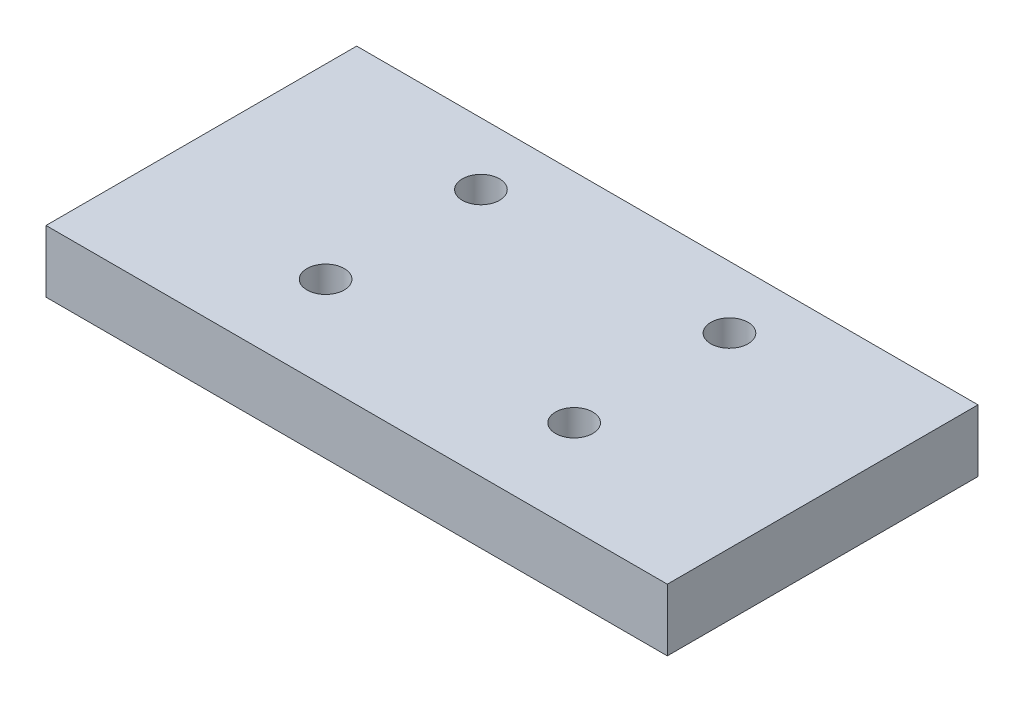
ISO-10303-21;
HEADER;
FILE_DESCRIPTION(('STEP AP214'),'2;1');
FILE_NAME('part.step','',(''),(''),'','','');
FILE_SCHEMA(('AUTOMOTIVE_DESIGN { 1 0 10303 214 1 1 1 1 }'));
ENDSEC;
DATA;
#1=APPLICATION_CONTEXT('core data for automotive mechanical design processes');
#2=APPLICATION_PROTOCOL_DEFINITION('international standard','automotive_design',2000,#1);
#3=PRODUCT_CONTEXT('',#1,'mechanical');
#4=PRODUCT('Part','Part','',(#3));
#5=PRODUCT_RELATED_PRODUCT_CATEGORY('part','',(#4));
#6=PRODUCT_DEFINITION_FORMATION('','',#4);
#7=PRODUCT_DEFINITION_CONTEXT('part definition',#1,'design');
#8=PRODUCT_DEFINITION('design','',#6,#7);
#9=PRODUCT_DEFINITION_SHAPE('','',#8);
#10=(LENGTH_UNIT() NAMED_UNIT(*) SI_UNIT(.MILLI.,.METRE.));
#11=(NAMED_UNIT(*) PLANE_ANGLE_UNIT() SI_UNIT($,.RADIAN.));
#12=(NAMED_UNIT(*) SI_UNIT($,.STERADIAN.) SOLID_ANGLE_UNIT());
#13=UNCERTAINTY_MEASURE_WITH_UNIT(LENGTH_MEASURE(1.E-05),#10,'distance_accuracy_value','');
#14=(GEOMETRIC_REPRESENTATION_CONTEXT(3) GLOBAL_UNCERTAINTY_ASSIGNED_CONTEXT((#13)) GLOBAL_UNIT_ASSIGNED_CONTEXT((#10,
#11,#12)) REPRESENTATION_CONTEXT('',''));
#15=CARTESIAN_POINT('',(0.,0.,0.));
#16=DIRECTION('',(0.,0.,1.));
#17=DIRECTION('',(1.,0.,0.));
#18=AXIS2_PLACEMENT_3D('',#15,#16,#17);
#19=CARTESIAN_POINT('',(0.,10.,0.));
#20=DIRECTION('',(0.,1.,0.));
#21=DIRECTION('',(0.,0.,1.));
#22=AXIS2_PLACEMENT_3D('',#19,#20,#21);
#23=PLANE('',#22);
#24=CARTESIAN_POINT('',(30.,10.,-40.));
#25=DIRECTION('',(0.,1.,0.));
#26=DIRECTION('',(0.,0.,1.));
#27=AXIS2_PLACEMENT_3D('',#24,#25,#26);
#28=CIRCLE('',#27,3.);
#29=CARTESIAN_POINT('',(30.,10.,-37.));
#30=VERTEX_POINT('',#29);
#31=EDGE_CURVE('E142',#30,#30,#28,.T.);
#32=ORIENTED_EDGE('',*,*,#31,.F.);
#33=EDGE_LOOP('',(#32));
#34=FACE_BOUND('',#33,.T.);
#35=CARTESIAN_POINT('',(30.,10.,-15.));
#36=DIRECTION('',(0.,1.,0.));
#37=DIRECTION('',(0.,0.,1.));
#38=AXIS2_PLACEMENT_3D('',#35,#36,#37);
#39=CIRCLE('',#38,3.);
#40=CARTESIAN_POINT('',(30.,10.,-12.));
#41=VERTEX_POINT('',#40);
#42=EDGE_CURVE('E112',#41,#41,#39,.T.);
#43=ORIENTED_EDGE('',*,*,#42,.F.);
#44=EDGE_LOOP('',(#43));
#45=FACE_BOUND('',#44,.T.);
#46=DIRECTION('',(0.,0.,1.));
#47=VECTOR('',#46,1.);
#48=CARTESIAN_POINT('',(0.,10.,-50.));
#49=LINE('',#48,#47);
#50=CARTESIAN_POINT('',(0.,10.,-50.));
#51=VERTEX_POINT('',#50);
#52=CARTESIAN_POINT('',(0.,10.,0.));
#53=VERTEX_POINT('',#52);
#54=EDGE_CURVE('E92',#51,#53,#49,.T.);
#55=ORIENTED_EDGE('',*,*,#54,.T.);
#56=DIRECTION('',(1.,0.,0.));
#57=VECTOR('',#56,1.);
#58=CARTESIAN_POINT('',(0.,10.,0.));
#59=LINE('',#58,#57);
#60=CARTESIAN_POINT('',(100.,10.,0.));
#61=VERTEX_POINT('',#60);
#62=EDGE_CURVE('E87',#53,#61,#59,.T.);
#63=ORIENTED_EDGE('',*,*,#62,.T.);
#64=DIRECTION('',(0.,0.,-1.));
#65=VECTOR('',#64,1.);
#66=CARTESIAN_POINT('',(100.,10.,0.));
#67=LINE('',#66,#65);
#68=CARTESIAN_POINT('',(100.,10.,-50.));
#69=VERTEX_POINT('',#68);
#70=EDGE_CURVE('E90',#61,#69,#67,.T.);
#71=ORIENTED_EDGE('',*,*,#70,.T.);
#72=DIRECTION('',(-1.,0.,0.));
#73=VECTOR('',#72,1.);
#74=CARTESIAN_POINT('',(100.,10.,-50.));
#75=LINE('',#74,#73);
#76=EDGE_CURVE('E57',#69,#51,#75,.T.);
#77=ORIENTED_EDGE('',*,*,#76,.T.);
#78=EDGE_LOOP('',(#55,#63,#71,#77));
#79=FACE_BOUND('',#78,.T.);
#80=CARTESIAN_POINT('',(70.,10.,-40.));
#81=DIRECTION('',(0.,1.,0.));
#82=DIRECTION('',(0.,0.,1.));
#83=AXIS2_PLACEMENT_3D('',#80,#81,#82);
#84=CIRCLE('',#83,3.00000000000001);
#85=CARTESIAN_POINT('',(70.,10.,-37.));
#86=VERTEX_POINT('',#85);
#87=EDGE_CURVE('E134',#86,#86,#84,.T.);
#88=ORIENTED_EDGE('',*,*,#87,.F.);
#89=EDGE_LOOP('',(#88));
#90=FACE_BOUND('',#89,.T.);
#91=CARTESIAN_POINT('',(70.,10.,-15.));
#92=DIRECTION('',(0.,1.,0.));
#93=DIRECTION('',(0.,0.,1.));
#94=AXIS2_PLACEMENT_3D('',#91,#92,#93);
#95=CIRCLE('',#94,3.00000000000001);
#96=CARTESIAN_POINT('',(70.,10.,-12.));
#97=VERTEX_POINT('',#96);
#98=EDGE_CURVE('E150',#97,#97,#95,.T.);
#99=ORIENTED_EDGE('',*,*,#98,.F.);
#100=EDGE_LOOP('',(#99));
#101=FACE_BOUND('',#100,.T.);
#102=ADVANCED_FACE('F39',(#34,#45,#79,#90,#101),#23,.T.);
#103=CARTESIAN_POINT('',(0.,0.,0.));
#104=DIRECTION('',(0.,1.,0.));
#105=DIRECTION('',(0.,0.,1.));
#106=AXIS2_PLACEMENT_3D('',#103,#104,#105);
#107=PLANE('',#106);
#108=DIRECTION('',(0.,0.,1.));
#109=VECTOR('',#108,1.);
#110=CARTESIAN_POINT('',(0.,0.,-50.));
#111=LINE('',#110,#109);
#112=CARTESIAN_POINT('',(0.,0.,-50.));
#113=VERTEX_POINT('',#112);
#114=CARTESIAN_POINT('',(0.,0.,0.));
#115=VERTEX_POINT('',#114);
#116=EDGE_CURVE('E108',#113,#115,#111,.T.);
#117=ORIENTED_EDGE('',*,*,#116,.F.);
#118=DIRECTION('',(-1.,0.,0.));
#119=VECTOR('',#118,1.);
#120=CARTESIAN_POINT('',(100.,0.,-50.));
#121=LINE('',#120,#119);
#122=CARTESIAN_POINT('',(100.,0.,-50.));
#123=VERTEX_POINT('',#122);
#124=EDGE_CURVE('E80',#123,#113,#121,.T.);
#125=ORIENTED_EDGE('',*,*,#124,.F.);
#126=DIRECTION('',(0.,0.,-1.));
#127=VECTOR('',#126,1.);
#128=CARTESIAN_POINT('',(100.,0.,0.));
#129=LINE('',#128,#127);
#130=CARTESIAN_POINT('',(100.,0.,0.));
#131=VERTEX_POINT('',#130);
#132=EDGE_CURVE('E74',#131,#123,#129,.T.);
#133=ORIENTED_EDGE('',*,*,#132,.F.);
#134=DIRECTION('',(1.,0.,0.));
#135=VECTOR('',#134,1.);
#136=CARTESIAN_POINT('',(0.,0.,0.));
#137=LINE('',#136,#135);
#138=EDGE_CURVE('E97',#115,#131,#137,.T.);
#139=ORIENTED_EDGE('',*,*,#138,.F.);
#140=EDGE_LOOP('',(#117,#125,#133,#139));
#141=FACE_BOUND('',#140,.T.);
#142=CARTESIAN_POINT('',(30.,0.,-15.));
#143=DIRECTION('',(0.,1.,0.));
#144=DIRECTION('',(0.,0.,1.));
#145=AXIS2_PLACEMENT_3D('',#142,#143,#144);
#146=CIRCLE('',#145,3.);
#147=CARTESIAN_POINT('',(30.,0.,-12.));
#148=VERTEX_POINT('',#147);
#149=EDGE_CURVE('E130',#148,#148,#146,.T.);
#150=ORIENTED_EDGE('',*,*,#149,.T.);
#151=EDGE_LOOP('',(#150));
#152=FACE_BOUND('',#151,.T.);
#153=CARTESIAN_POINT('',(70.,0.,-40.));
#154=DIRECTION('',(0.,1.,0.));
#155=DIRECTION('',(0.,0.,1.));
#156=AXIS2_PLACEMENT_3D('',#153,#154,#155);
#157=CIRCLE('',#156,3.00000000000001);
#158=CARTESIAN_POINT('',(70.,0.,-37.));
#159=VERTEX_POINT('',#158);
#160=EDGE_CURVE('E138',#159,#159,#157,.T.);
#161=ORIENTED_EDGE('',*,*,#160,.T.);
#162=EDGE_LOOP('',(#161));
#163=FACE_BOUND('',#162,.T.);
#164=CARTESIAN_POINT('',(30.,0.,-40.));
#165=DIRECTION('',(0.,1.,0.));
#166=DIRECTION('',(0.,0.,1.));
#167=AXIS2_PLACEMENT_3D('',#164,#165,#166);
#168=CIRCLE('',#167,3.);
#169=CARTESIAN_POINT('',(30.,0.,-37.));
#170=VERTEX_POINT('',#169);
#171=EDGE_CURVE('E146',#170,#170,#168,.T.);
#172=ORIENTED_EDGE('',*,*,#171,.T.);
#173=EDGE_LOOP('',(#172));
#174=FACE_BOUND('',#173,.T.);
#175=CARTESIAN_POINT('',(70.,0.,-15.));
#176=DIRECTION('',(0.,1.,0.));
#177=DIRECTION('',(0.,0.,1.));
#178=AXIS2_PLACEMENT_3D('',#175,#176,#177);
#179=CIRCLE('',#178,3.00000000000001);
#180=CARTESIAN_POINT('',(70.,0.,-12.));
#181=VERTEX_POINT('',#180);
#182=EDGE_CURVE('E154',#181,#181,#179,.T.);
#183=ORIENTED_EDGE('',*,*,#182,.T.);
#184=EDGE_LOOP('',(#183));
#185=FACE_BOUND('',#184,.T.);
#186=ADVANCED_FACE('F125',(#141,#152,#163,#174,#185),#107,.F.);
#187=CARTESIAN_POINT('',(0.,10.,-50.));
#188=DIRECTION('',(1.,0.,0.));
#189=DIRECTION('',(0.,0.,-1.));
#190=AXIS2_PLACEMENT_3D('',#187,#188,#189);
#191=PLANE('',#190);
#192=ORIENTED_EDGE('',*,*,#116,.T.);
#193=DIRECTION('',(0.,-1.,0.));
#194=VECTOR('',#193,1.);
#195=CARTESIAN_POINT('',(0.,10.,0.));
#196=LINE('',#195,#194);
#197=EDGE_CURVE('E11',#53,#115,#196,.T.);
#198=ORIENTED_EDGE('',*,*,#197,.F.);
#199=ORIENTED_EDGE('',*,*,#54,.F.);
#200=DIRECTION('',(0.,-1.,0.));
#201=VECTOR('',#200,1.);
#202=CARTESIAN_POINT('',(0.,10.,-50.));
#203=LINE('',#202,#201);
#204=EDGE_CURVE('E104',#51,#113,#203,.T.);
#205=ORIENTED_EDGE('',*,*,#204,.T.);
#206=EDGE_LOOP('',(#192,#198,#199,#205));
#207=FACE_BOUND('',#206,.T.);
#208=ADVANCED_FACE('F41',(#207),#191,.F.);
#209=CARTESIAN_POINT('',(0.,10.,0.));
#210=DIRECTION('',(0.,0.,-1.));
#211=DIRECTION('',(-1.,0.,0.));
#212=AXIS2_PLACEMENT_3D('',#209,#210,#211);
#213=PLANE('',#212);
#214=ORIENTED_EDGE('',*,*,#138,.T.);
#215=DIRECTION('',(0.,-1.,0.));
#216=VECTOR('',#215,1.);
#217=CARTESIAN_POINT('',(100.,10.,0.));
#218=LINE('',#217,#216);
#219=EDGE_CURVE('E49',#61,#131,#218,.T.);
#220=ORIENTED_EDGE('',*,*,#219,.F.);
#221=ORIENTED_EDGE('',*,*,#62,.F.);
#222=ORIENTED_EDGE('',*,*,#197,.T.);
#223=EDGE_LOOP('',(#214,#220,#221,#222));
#224=FACE_BOUND('',#223,.T.);
#225=ADVANCED_FACE('F96',(#224),#213,.F.);
#226=CARTESIAN_POINT('',(100.,10.,0.));
#227=DIRECTION('',(-1.,0.,0.));
#228=DIRECTION('',(0.,0.,1.));
#229=AXIS2_PLACEMENT_3D('',#226,#227,#228);
#230=PLANE('',#229);
#231=ORIENTED_EDGE('',*,*,#132,.T.);
#232=DIRECTION('',(0.,-1.,0.));
#233=VECTOR('',#232,1.);
#234=CARTESIAN_POINT('',(100.,10.,-50.));
#235=LINE('',#234,#233);
#236=EDGE_CURVE('E99',#69,#123,#235,.T.);
#237=ORIENTED_EDGE('',*,*,#236,.F.);
#238=ORIENTED_EDGE('',*,*,#70,.F.);
#239=ORIENTED_EDGE('',*,*,#219,.T.);
#240=EDGE_LOOP('',(#231,#237,#238,#239));
#241=FACE_BOUND('',#240,.T.);
#242=ADVANCED_FACE('F100',(#241),#230,.F.);
#243=CARTESIAN_POINT('',(100.,10.,-50.));
#244=DIRECTION('',(0.,0.,1.));
#245=DIRECTION('',(1.,0.,0.));
#246=AXIS2_PLACEMENT_3D('',#243,#244,#245);
#247=PLANE('',#246);
#248=ORIENTED_EDGE('',*,*,#124,.T.);
#249=ORIENTED_EDGE('',*,*,#204,.F.);
#250=ORIENTED_EDGE('',*,*,#76,.F.);
#251=ORIENTED_EDGE('',*,*,#236,.T.);
#252=EDGE_LOOP('',(#248,#249,#250,#251));
#253=FACE_BOUND('',#252,.T.);
#254=ADVANCED_FACE('F122',(#253),#247,.F.);
#255=CARTESIAN_POINT('',(30.,10.,-15.));
#256=DIRECTION('',(0.,-1.,0.));
#257=DIRECTION('',(0.,0.,-1.));
#258=AXIS2_PLACEMENT_3D('',#255,#256,#257);
#259=CYLINDRICAL_SURFACE('',#258,3.);
#260=ORIENTED_EDGE('',*,*,#42,.T.);
#261=EDGE_LOOP('',(#260));
#262=FACE_BOUND('',#261,.T.);
#263=ORIENTED_EDGE('',*,*,#149,.F.);
#264=EDGE_LOOP('',(#263));
#265=FACE_BOUND('',#264,.T.);
#266=ADVANCED_FACE('F175',(#262,#265),#259,.F.);
#267=CARTESIAN_POINT('',(70.,10.,-40.));
#268=DIRECTION('',(0.,-1.,0.));
#269=DIRECTION('',(0.,0.,-1.));
#270=AXIS2_PLACEMENT_3D('',#267,#268,#269);
#271=CYLINDRICAL_SURFACE('',#270,3.00000000000001);
#272=ORIENTED_EDGE('',*,*,#87,.T.);
#273=EDGE_LOOP('',(#272));
#274=FACE_BOUND('',#273,.T.);
#275=ORIENTED_EDGE('',*,*,#160,.F.);
#276=EDGE_LOOP('',(#275));
#277=FACE_BOUND('',#276,.T.);
#278=ADVANCED_FACE('F221',(#274,#277),#271,.F.);
#279=CARTESIAN_POINT('',(30.,10.,-40.));
#280=DIRECTION('',(0.,-1.,0.));
#281=DIRECTION('',(0.,0.,-1.));
#282=AXIS2_PLACEMENT_3D('',#279,#280,#281);
#283=CYLINDRICAL_SURFACE('',#282,3.);
#284=ORIENTED_EDGE('',*,*,#31,.T.);
#285=EDGE_LOOP('',(#284));
#286=FACE_BOUND('',#285,.T.);
#287=ORIENTED_EDGE('',*,*,#171,.F.);
#288=EDGE_LOOP('',(#287));
#289=FACE_BOUND('',#288,.T.);
#290=ADVANCED_FACE('F229',(#286,#289),#283,.F.);
#291=CARTESIAN_POINT('',(70.,10.,-15.));
#292=DIRECTION('',(0.,-1.,0.));
#293=DIRECTION('',(0.,0.,-1.));
#294=AXIS2_PLACEMENT_3D('',#291,#292,#293);
#295=CYLINDRICAL_SURFACE('',#294,3.00000000000001);
#296=ORIENTED_EDGE('',*,*,#98,.T.);
#297=EDGE_LOOP('',(#296));
#298=FACE_BOUND('',#297,.T.);
#299=ORIENTED_EDGE('',*,*,#182,.F.);
#300=EDGE_LOOP('',(#299));
#301=FACE_BOUND('',#300,.T.);
#302=ADVANCED_FACE('F162',(#298,#301),#295,.F.);
#303=CLOSED_SHELL('',(#102,#186,#208,#225,#242,#254,#266,#278,#290,#302));
#304=MANIFOLD_SOLID_BREP('B2',#303);
#305=ADVANCED_BREP_SHAPE_REPRESENTATION('',(#18,#304),#14);
#306=SHAPE_DEFINITION_REPRESENTATION(#9,#305);
ENDSEC;
END-ISO-10303-21;
